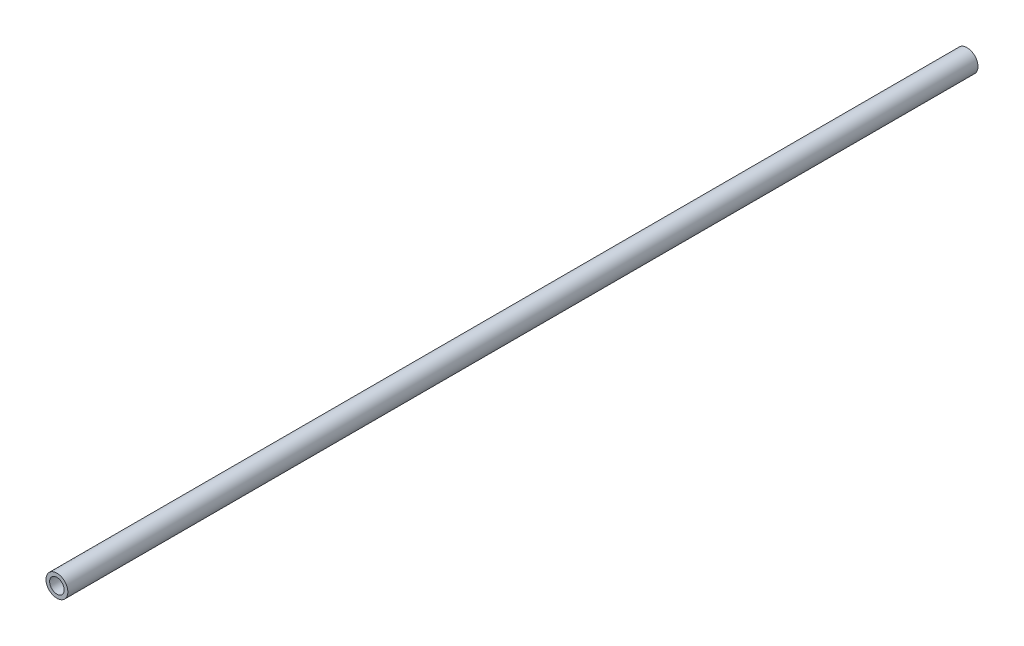
ISO-10303-21;
HEADER;
FILE_DESCRIPTION(('STEP AP214'),'2;1');
FILE_NAME('part.step','',(''),(''),'','','');
FILE_SCHEMA(('AUTOMOTIVE_DESIGN { 1 0 10303 214 1 1 1 1 }'));
ENDSEC;
DATA;
#1=APPLICATION_CONTEXT('core data for automotive mechanical design processes');
#2=APPLICATION_PROTOCOL_DEFINITION('international standard','automotive_design',2000,#1);
#3=PRODUCT_CONTEXT('',#1,'mechanical');
#4=PRODUCT('Part','Part','',(#3));
#5=PRODUCT_RELATED_PRODUCT_CATEGORY('part','',(#4));
#6=PRODUCT_DEFINITION_FORMATION('','',#4);
#7=PRODUCT_DEFINITION_CONTEXT('part definition',#1,'design');
#8=PRODUCT_DEFINITION('design','',#6,#7);
#9=PRODUCT_DEFINITION_SHAPE('','',#8);
#10=(LENGTH_UNIT() NAMED_UNIT(*) SI_UNIT(.MILLI.,.METRE.));
#11=(NAMED_UNIT(*) PLANE_ANGLE_UNIT() SI_UNIT($,.RADIAN.));
#12=(NAMED_UNIT(*) SI_UNIT($,.STERADIAN.) SOLID_ANGLE_UNIT());
#13=UNCERTAINTY_MEASURE_WITH_UNIT(LENGTH_MEASURE(1.E-05),#10,'distance_accuracy_value','');
#14=(GEOMETRIC_REPRESENTATION_CONTEXT(3) GLOBAL_UNCERTAINTY_ASSIGNED_CONTEXT((#13)) GLOBAL_UNIT_ASSIGNED_CONTEXT((#10,
#11,#12)) REPRESENTATION_CONTEXT('',''));
#15=CARTESIAN_POINT('',(0.,0.,0.));
#16=DIRECTION('',(0.,0.,1.));
#17=DIRECTION('',(1.,0.,0.));
#18=AXIS2_PLACEMENT_3D('',#15,#16,#17);
#19=CARTESIAN_POINT('',(0.,0.,635.));
#20=DIRECTION('',(0.,0.,1.));
#21=DIRECTION('',(1.,0.,0.));
#22=AXIS2_PLACEMENT_3D('',#19,#20,#21);
#23=PLANE('',#22);
#24=CARTESIAN_POINT('',(0.,0.,635.));
#25=DIRECTION('',(0.,0.,1.));
#26=DIRECTION('',(1.,0.,0.));
#27=AXIS2_PLACEMENT_3D('',#24,#25,#26);
#28=CIRCLE('',#27,7.62);
#29=CARTESIAN_POINT('',(7.62,0.,635.));
#30=VERTEX_POINT('',#29);
#31=EDGE_CURVE('E10',#30,#30,#28,.T.);
#32=ORIENTED_EDGE('',*,*,#31,.T.);
#33=EDGE_LOOP('',(#32));
#34=FACE_BOUND('',#33,.T.);
#35=CARTESIAN_POINT('',(0.,0.,635.));
#36=DIRECTION('',(0.,0.,1.));
#37=DIRECTION('',(1.,0.,0.));
#38=AXIS2_PLACEMENT_3D('',#35,#36,#37);
#39=CIRCLE('',#38,5.08);
#40=CARTESIAN_POINT('',(5.08,0.,635.));
#41=VERTEX_POINT('',#40);
#42=EDGE_CURVE('E41',#41,#41,#39,.T.);
#43=ORIENTED_EDGE('',*,*,#42,.F.);
#44=EDGE_LOOP('',(#43));
#45=FACE_BOUND('',#44,.T.);
#46=ADVANCED_FACE('F30',(#34,#45),#23,.T.);
#47=CARTESIAN_POINT('',(0.,0.,0.));
#48=DIRECTION('',(0.,0.,1.));
#49=DIRECTION('',(1.,0.,0.));
#50=AXIS2_PLACEMENT_3D('',#47,#48,#49);
#51=PLANE('',#50);
#52=CARTESIAN_POINT('',(0.,0.,0.));
#53=DIRECTION('',(0.,0.,1.));
#54=DIRECTION('',(1.,0.,0.));
#55=AXIS2_PLACEMENT_3D('',#52,#53,#54);
#56=CIRCLE('',#55,7.62);
#57=CARTESIAN_POINT('',(7.62,0.,0.));
#58=VERTEX_POINT('',#57);
#59=EDGE_CURVE('E34',#58,#58,#56,.T.);
#60=ORIENTED_EDGE('',*,*,#59,.F.);
#61=EDGE_LOOP('',(#60));
#62=FACE_BOUND('',#61,.T.);
#63=CARTESIAN_POINT('',(0.,0.,0.));
#64=DIRECTION('',(0.,0.,1.));
#65=DIRECTION('',(1.,0.,0.));
#66=AXIS2_PLACEMENT_3D('',#63,#64,#65);
#67=CIRCLE('',#66,5.08);
#68=CARTESIAN_POINT('',(5.08,0.,0.));
#69=VERTEX_POINT('',#68);
#70=EDGE_CURVE('E43',#69,#69,#67,.T.);
#71=ORIENTED_EDGE('',*,*,#70,.T.);
#72=EDGE_LOOP('',(#71));
#73=FACE_BOUND('',#72,.T.);
#74=ADVANCED_FACE('F53',(#62,#73),#51,.F.);
#75=CARTESIAN_POINT('',(0.,0.,635.));
#76=DIRECTION('',(0.,0.,-1.));
#77=DIRECTION('',(-1.,0.,0.));
#78=AXIS2_PLACEMENT_3D('',#75,#76,#77);
#79=CYLINDRICAL_SURFACE('',#78,7.62);
#80=ORIENTED_EDGE('',*,*,#31,.F.);
#81=EDGE_LOOP('',(#80));
#82=FACE_BOUND('',#81,.T.);
#83=ORIENTED_EDGE('',*,*,#59,.T.);
#84=EDGE_LOOP('',(#83));
#85=FACE_BOUND('',#84,.T.);
#86=ADVANCED_FACE('F32',(#82,#85),#79,.T.);
#87=CARTESIAN_POINT('',(0.,0.,635.));
#88=DIRECTION('',(0.,0.,-1.));
#89=DIRECTION('',(-1.,0.,0.));
#90=AXIS2_PLACEMENT_3D('',#87,#88,#89);
#91=CYLINDRICAL_SURFACE('',#90,5.08);
#92=ORIENTED_EDGE('',*,*,#42,.T.);
#93=EDGE_LOOP('',(#92));
#94=FACE_BOUND('',#93,.T.);
#95=ORIENTED_EDGE('',*,*,#70,.F.);
#96=EDGE_LOOP('',(#95));
#97=FACE_BOUND('',#96,.T.);
#98=ADVANCED_FACE('F49',(#94,#97),#91,.F.);
#99=CLOSED_SHELL('',(#46,#74,#86,#98));
#100=MANIFOLD_SOLID_BREP('B2',#99);
#101=ADVANCED_BREP_SHAPE_REPRESENTATION('',(#18,#100),#14);
#102=SHAPE_DEFINITION_REPRESENTATION(#9,#101);
ENDSEC;
END-ISO-10303-21;
